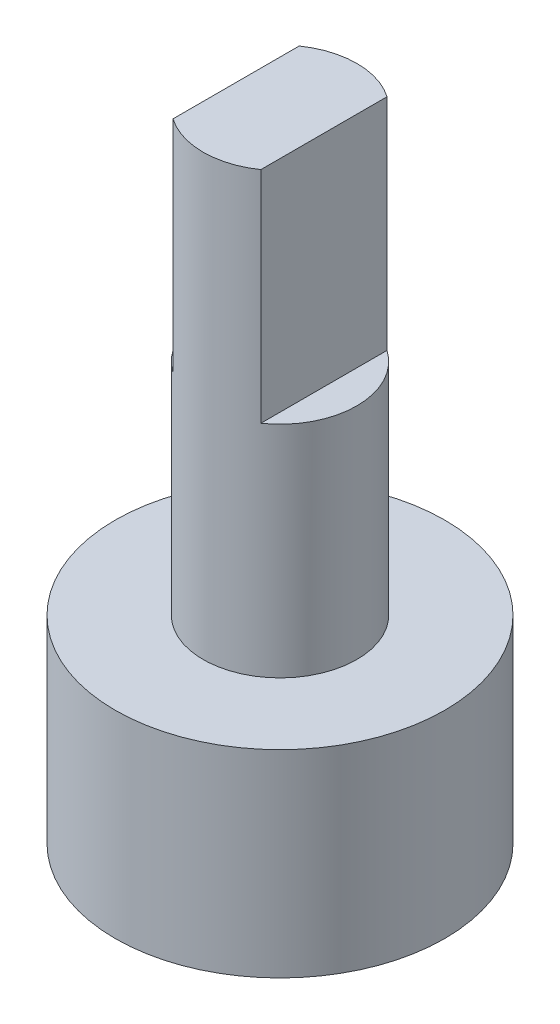
ISO-10303-21;
HEADER;
FILE_DESCRIPTION(('STEP AP214'),'2;1');
FILE_NAME('part.step','',(''),(''),'','','');
FILE_SCHEMA(('AUTOMOTIVE_DESIGN { 1 0 10303 214 1 1 1 1 }'));
ENDSEC;
DATA;
#1=APPLICATION_CONTEXT('core data for automotive mechanical design processes');
#2=APPLICATION_PROTOCOL_DEFINITION('international standard','automotive_design',2000,#1);
#3=PRODUCT_CONTEXT('',#1,'mechanical');
#4=PRODUCT('Part','Part','',(#3));
#5=PRODUCT_RELATED_PRODUCT_CATEGORY('part','',(#4));
#6=PRODUCT_DEFINITION_FORMATION('','',#4);
#7=PRODUCT_DEFINITION_CONTEXT('part definition',#1,'design');
#8=PRODUCT_DEFINITION('design','',#6,#7);
#9=PRODUCT_DEFINITION_SHAPE('','',#8);
#10=(LENGTH_UNIT() NAMED_UNIT(*) SI_UNIT(.MILLI.,.METRE.));
#11=(NAMED_UNIT(*) PLANE_ANGLE_UNIT() SI_UNIT($,.RADIAN.));
#12=(NAMED_UNIT(*) SI_UNIT($,.STERADIAN.) SOLID_ANGLE_UNIT());
#13=UNCERTAINTY_MEASURE_WITH_UNIT(LENGTH_MEASURE(1.E-05),#10,'distance_accuracy_value','');
#14=(GEOMETRIC_REPRESENTATION_CONTEXT(3) GLOBAL_UNCERTAINTY_ASSIGNED_CONTEXT((#13)) GLOBAL_UNIT_ASSIGNED_CONTEXT((#10,
#11,#12)) REPRESENTATION_CONTEXT('',''));
#15=CARTESIAN_POINT('',(0.,0.,0.));
#16=DIRECTION('',(0.,0.,1.));
#17=DIRECTION('',(1.,0.,0.));
#18=AXIS2_PLACEMENT_3D('',#15,#16,#17);
#19=CARTESIAN_POINT('',(0.,10.,0.));
#20=DIRECTION('',(0.,-1.,0.));
#21=DIRECTION('',(0.,0.,-1.));
#22=AXIS2_PLACEMENT_3D('',#19,#20,#21);
#23=CYLINDRICAL_SURFACE('',#22,1.75);
#24=CARTESIAN_POINT('',(0.,10.,0.));
#25=DIRECTION('',(0.,1.,0.));
#26=DIRECTION('',(0.,0.,1.));
#27=AXIS2_PLACEMENT_3D('',#24,#25,#26);
#28=CIRCLE('',#27,1.75);
#29=CARTESIAN_POINT('',(1.,10.,-1.43614066163451));
#30=VERTEX_POINT('',#29);
#31=CARTESIAN_POINT('',(-1.,10.,-1.43614066163451));
#32=VERTEX_POINT('',#31);
#33=EDGE_CURVE('E38',#30,#32,#28,.T.);
#34=ORIENTED_EDGE('',*,*,#33,.F.);
#35=DIRECTION('',(0.,1.,0.));
#36=VECTOR('',#35,1.);
#37=CARTESIAN_POINT('',(1.,5.,-1.43614066163451));
#38=LINE('',#37,#36);
#39=CARTESIAN_POINT('',(1.,5.,-1.43614066163451));
#40=VERTEX_POINT('',#39);
#41=EDGE_CURVE('E45',#40,#30,#38,.T.);
#42=ORIENTED_EDGE('',*,*,#41,.F.);
#43=CARTESIAN_POINT('',(0.,5.,0.));
#44=DIRECTION('',(0.,1.,0.));
#45=DIRECTION('',(0.,0.,1.));
#46=AXIS2_PLACEMENT_3D('',#43,#44,#45);
#47=CIRCLE('',#46,1.75);
#48=CARTESIAN_POINT('',(1.,5.,1.43614066163451));
#49=VERTEX_POINT('',#48);
#50=EDGE_CURVE('E74',#49,#40,#47,.T.);
#51=ORIENTED_EDGE('',*,*,#50,.F.);
#52=DIRECTION('',(0.,1.,0.));
#53=VECTOR('',#52,1.);
#54=CARTESIAN_POINT('',(1.,5.,1.43614066163451));
#55=LINE('',#54,#53);
#56=CARTESIAN_POINT('',(1.,10.,1.43614066163451));
#57=VERTEX_POINT('',#56);
#58=EDGE_CURVE('E82',#49,#57,#55,.T.);
#59=ORIENTED_EDGE('',*,*,#58,.T.);
#60=CARTESIAN_POINT('',(-1.,10.,1.43614066163451));
#61=VERTEX_POINT('',#60);
#62=EDGE_CURVE('E11',#61,#57,#28,.T.);
#63=ORIENTED_EDGE('',*,*,#62,.F.);
#64=DIRECTION('',(0.,1.,0.));
#65=VECTOR('',#64,1.);
#66=CARTESIAN_POINT('',(-1.,5.,1.43614066163451));
#67=LINE('',#66,#65);
#68=CARTESIAN_POINT('',(-1.,5.,1.43614066163451));
#69=VERTEX_POINT('',#68);
#70=EDGE_CURVE('E53',#69,#61,#67,.T.);
#71=ORIENTED_EDGE('',*,*,#70,.F.);
#72=CARTESIAN_POINT('',(0.,5.,0.));
#73=DIRECTION('',(0.,1.,0.));
#74=DIRECTION('',(0.,0.,1.));
#75=AXIS2_PLACEMENT_3D('',#72,#73,#74);
#76=CIRCLE('',#75,1.75);
#77=CARTESIAN_POINT('',(-1.,5.,-1.43614066163451));
#78=VERTEX_POINT('',#77);
#79=EDGE_CURVE('E92',#78,#69,#76,.T.);
#80=ORIENTED_EDGE('',*,*,#79,.F.);
#81=DIRECTION('',(0.,1.,0.));
#82=VECTOR('',#81,1.);
#83=CARTESIAN_POINT('',(-1.,5.,-1.43614066163451));
#84=LINE('',#83,#82);
#85=EDGE_CURVE('E98',#78,#32,#84,.T.);
#86=ORIENTED_EDGE('',*,*,#85,.T.);
#87=EDGE_LOOP('',(#34,#42,#51,#59,#63,#71,#80,#86));
#88=FACE_BOUND('',#87,.T.);
#89=CARTESIAN_POINT('',(0.,0.,0.));
#90=DIRECTION('',(0.,-1.,0.));
#91=DIRECTION('',(0.,0.,-1.));
#92=AXIS2_PLACEMENT_3D('',#89,#90,#91);
#93=CIRCLE('',#92,1.75);
#94=CARTESIAN_POINT('',(0.,0.,-1.75));
#95=VERTEX_POINT('',#94);
#96=EDGE_CURVE('E234',#95,#95,#93,.T.);
#97=ORIENTED_EDGE('',*,*,#96,.F.);
#98=EDGE_LOOP('',(#97));
#99=FACE_BOUND('',#98,.T.);
#100=ADVANCED_FACE('F31',(#88,#99),#23,.T.);
#101=CARTESIAN_POINT('',(0.,10.,0.));
#102=DIRECTION('',(0.,1.,0.));
#103=DIRECTION('',(0.,0.,1.));
#104=AXIS2_PLACEMENT_3D('',#101,#102,#103);
#105=PLANE('',#104);
#106=DIRECTION('',(0.,0.,1.));
#107=VECTOR('',#106,1.);
#108=CARTESIAN_POINT('',(1.,10.,-1.43614066163451));
#109=LINE('',#108,#107);
#110=EDGE_CURVE('E79',#30,#57,#109,.T.);
#111=ORIENTED_EDGE('',*,*,#110,.F.);
#112=ORIENTED_EDGE('',*,*,#33,.T.);
#113=DIRECTION('',(0.,0.,-1.));
#114=VECTOR('',#113,1.);
#115=CARTESIAN_POINT('',(-1.,10.,-1.43614066163451));
#116=LINE('',#115,#114);
#117=EDGE_CURVE('E88',#61,#32,#116,.T.);
#118=ORIENTED_EDGE('',*,*,#117,.F.);
#119=ORIENTED_EDGE('',*,*,#62,.T.);
#120=EDGE_LOOP('',(#111,#112,#118,#119));
#121=FACE_BOUND('',#120,.T.);
#122=ADVANCED_FACE('F101',(#121),#105,.T.);
#123=CARTESIAN_POINT('',(-1.,5.,-1.43614066163451));
#124=DIRECTION('',(1.,0.,0.));
#125=DIRECTION('',(0.,0.,-1.));
#126=AXIS2_PLACEMENT_3D('',#123,#124,#125);
#127=PLANE('',#126);
#128=ORIENTED_EDGE('',*,*,#117,.T.);
#129=ORIENTED_EDGE('',*,*,#85,.F.);
#130=DIRECTION('',(0.,0.,-1.));
#131=VECTOR('',#130,1.);
#132=CARTESIAN_POINT('',(-1.,5.,-1.43614066163451));
#133=LINE('',#132,#131);
#134=EDGE_CURVE('E94',#69,#78,#133,.T.);
#135=ORIENTED_EDGE('',*,*,#134,.F.);
#136=ORIENTED_EDGE('',*,*,#70,.T.);
#137=EDGE_LOOP('',(#128,#129,#135,#136));
#138=FACE_BOUND('',#137,.T.);
#139=ADVANCED_FACE('F103',(#138),#127,.F.);
#140=CARTESIAN_POINT('',(0.,5.,0.));
#141=DIRECTION('',(0.,1.,0.));
#142=DIRECTION('',(0.,0.,1.));
#143=AXIS2_PLACEMENT_3D('',#140,#141,#142);
#144=PLANE('',#143);
#145=ORIENTED_EDGE('',*,*,#79,.T.);
#146=ORIENTED_EDGE('',*,*,#134,.T.);
#147=EDGE_LOOP('',(#145,#146));
#148=FACE_BOUND('',#147,.T.);
#149=ADVANCED_FACE('F105',(#148),#144,.T.);
#150=CARTESIAN_POINT('',(1.,5.,-1.43614066163451));
#151=DIRECTION('',(-1.,0.,0.));
#152=DIRECTION('',(0.,0.,1.));
#153=AXIS2_PLACEMENT_3D('',#150,#151,#152);
#154=PLANE('',#153);
#155=ORIENTED_EDGE('',*,*,#110,.T.);
#156=ORIENTED_EDGE('',*,*,#58,.F.);
#157=DIRECTION('',(0.,0.,1.));
#158=VECTOR('',#157,1.);
#159=CARTESIAN_POINT('',(1.,5.,-1.43614066163451));
#160=LINE('',#159,#158);
#161=EDGE_CURVE('E76',#40,#49,#160,.T.);
#162=ORIENTED_EDGE('',*,*,#161,.F.);
#163=ORIENTED_EDGE('',*,*,#41,.T.);
#164=EDGE_LOOP('',(#155,#156,#162,#163));
#165=FACE_BOUND('',#164,.T.);
#166=ADVANCED_FACE('F81',(#165),#154,.F.);
#167=CARTESIAN_POINT('',(0.,5.,0.));
#168=DIRECTION('',(0.,1.,0.));
#169=DIRECTION('',(0.,0.,1.));
#170=AXIS2_PLACEMENT_3D('',#167,#168,#169);
#171=PLANE('',#170);
#172=ORIENTED_EDGE('',*,*,#50,.T.);
#173=ORIENTED_EDGE('',*,*,#161,.T.);
#174=EDGE_LOOP('',(#172,#173));
#175=FACE_BOUND('',#174,.T.);
#176=ADVANCED_FACE('F75',(#175),#171,.T.);
#177=CARTESIAN_POINT('',(0.,0.,0.));
#178=DIRECTION('',(0.,-1.,0.));
#179=DIRECTION('',(0.,0.,-1.));
#180=AXIS2_PLACEMENT_3D('',#177,#178,#179);
#181=PLANE('',#180);
#182=CARTESIAN_POINT('',(0.,0.,0.));
#183=DIRECTION('',(0.,-1.,0.));
#184=DIRECTION('',(0.,0.,-1.));
#185=AXIS2_PLACEMENT_3D('',#182,#183,#184);
#186=CIRCLE('',#185,3.75);
#187=CARTESIAN_POINT('',(0.,0.,-3.75));
#188=VERTEX_POINT('',#187);
#189=EDGE_CURVE('E229',#188,#188,#186,.T.);
#190=ORIENTED_EDGE('',*,*,#189,.F.);
#191=EDGE_LOOP('',(#190));
#192=FACE_BOUND('',#191,.T.);
#193=ORIENTED_EDGE('',*,*,#96,.T.);
#194=EDGE_LOOP('',(#193));
#195=FACE_BOUND('',#194,.T.);
#196=ADVANCED_FACE('F143',(#192,#195),#181,.F.);
#197=CARTESIAN_POINT('',(0.,-4.5,0.));
#198=DIRECTION('',(0.,1.,0.));
#199=DIRECTION('',(0.,0.,1.));
#200=AXIS2_PLACEMENT_3D('',#197,#198,#199);
#201=CYLINDRICAL_SURFACE('',#200,3.75);
#202=CARTESIAN_POINT('',(0.,-4.5,0.));
#203=DIRECTION('',(0.,-1.,0.));
#204=DIRECTION('',(0.,0.,-1.));
#205=AXIS2_PLACEMENT_3D('',#202,#203,#204);
#206=CIRCLE('',#205,3.75);
#207=CARTESIAN_POINT('',(0.,-4.5,-3.75));
#208=VERTEX_POINT('',#207);
#209=EDGE_CURVE('E231',#208,#208,#206,.T.);
#210=ORIENTED_EDGE('',*,*,#209,.F.);
#211=EDGE_LOOP('',(#210));
#212=FACE_BOUND('',#211,.T.);
#213=ORIENTED_EDGE('',*,*,#189,.T.);
#214=EDGE_LOOP('',(#213));
#215=FACE_BOUND('',#214,.T.);
#216=ADVANCED_FACE('F152',(#212,#215),#201,.T.);
#217=CARTESIAN_POINT('',(0.,-4.5,0.));
#218=DIRECTION('',(0.,-1.,0.));
#219=DIRECTION('',(0.,0.,-1.));
#220=AXIS2_PLACEMENT_3D('',#217,#218,#219);
#221=PLANE('',#220);
#222=CARTESIAN_POINT('',(0.,-4.5,0.));
#223=DIRECTION('',(0.,-1.,0.));
#224=DIRECTION('',(0.,0.,-1.));
#225=AXIS2_PLACEMENT_3D('',#222,#223,#224);
#226=CIRCLE('',#225,3.25);
#227=CARTESIAN_POINT('',(0.,-4.5,-3.25));
#228=VERTEX_POINT('',#227);
#229=EDGE_CURVE('E219',#228,#228,#226,.T.);
#230=ORIENTED_EDGE('',*,*,#229,.F.);
#231=EDGE_LOOP('',(#230));
#232=FACE_BOUND('',#231,.T.);
#233=ORIENTED_EDGE('',*,*,#209,.T.);
#234=EDGE_LOOP('',(#233));
#235=FACE_BOUND('',#234,.T.);
#236=ADVANCED_FACE('F162',(#232,#235),#221,.T.);
#237=CARTESIAN_POINT('',(0.,-2.,0.));
#238=DIRECTION('',(0.,-1.,0.));
#239=DIRECTION('',(0.,0.,-1.));
#240=AXIS2_PLACEMENT_3D('',#237,#238,#239);
#241=CYLINDRICAL_SURFACE('',#240,3.25);
#242=CARTESIAN_POINT('',(0.,-2.,0.));
#243=DIRECTION('',(0.,-1.,0.));
#244=DIRECTION('',(0.,0.,-1.));
#245=AXIS2_PLACEMENT_3D('',#242,#243,#244);
#246=CIRCLE('',#245,3.25);
#247=CARTESIAN_POINT('',(0.,-2.,-3.25));
#248=VERTEX_POINT('',#247);
#249=EDGE_CURVE('E223',#248,#248,#246,.T.);
#250=ORIENTED_EDGE('',*,*,#249,.F.);
#251=EDGE_LOOP('',(#250));
#252=FACE_BOUND('',#251,.T.);
#253=ORIENTED_EDGE('',*,*,#229,.T.);
#254=EDGE_LOOP('',(#253));
#255=FACE_BOUND('',#254,.T.);
#256=ADVANCED_FACE('F172',(#252,#255),#241,.F.);
#257=CARTESIAN_POINT('',(0.,-2.,0.));
#258=DIRECTION('',(0.,-1.,0.));
#259=DIRECTION('',(0.,0.,-1.));
#260=AXIS2_PLACEMENT_3D('',#257,#258,#259);
#261=PLANE('',#260);
#262=CARTESIAN_POINT('',(0.,-2.,0.));
#263=DIRECTION('',(0.,-1.,0.));
#264=DIRECTION('',(0.,0.,-1.));
#265=AXIS2_PLACEMENT_3D('',#262,#263,#264);
#266=CIRCLE('',#265,2.5);
#267=CARTESIAN_POINT('',(0.,-2.,-2.5));
#268=VERTEX_POINT('',#267);
#269=EDGE_CURVE('E220',#268,#268,#266,.T.);
#270=ORIENTED_EDGE('',*,*,#269,.F.);
#271=EDGE_LOOP('',(#270));
#272=FACE_BOUND('',#271,.T.);
#273=ORIENTED_EDGE('',*,*,#249,.T.);
#274=EDGE_LOOP('',(#273));
#275=FACE_BOUND('',#274,.T.);
#276=ADVANCED_FACE('F182',(#272,#275),#261,.T.);
#277=CARTESIAN_POINT('',(0.,-1.,0.));
#278=DIRECTION('',(0.,-1.,0.));
#279=DIRECTION('',(0.,0.,-1.));
#280=AXIS2_PLACEMENT_3D('',#277,#278,#279);
#281=CYLINDRICAL_SURFACE('',#280,2.5);
#282=CARTESIAN_POINT('',(0.,-1.,0.));
#283=DIRECTION('',(0.,-1.,0.));
#284=DIRECTION('',(0.,0.,-1.));
#285=AXIS2_PLACEMENT_3D('',#282,#283,#284);
#286=CIRCLE('',#285,2.5);
#287=CARTESIAN_POINT('',(0.,-1.,-2.5));
#288=VERTEX_POINT('',#287);
#289=EDGE_CURVE('E218',#288,#288,#286,.T.);
#290=ORIENTED_EDGE('',*,*,#289,.F.);
#291=EDGE_LOOP('',(#290));
#292=FACE_BOUND('',#291,.T.);
#293=ORIENTED_EDGE('',*,*,#269,.T.);
#294=EDGE_LOOP('',(#293));
#295=FACE_BOUND('',#294,.T.);
#296=ADVANCED_FACE('F192',(#292,#295),#281,.F.);
#297=CARTESIAN_POINT('',(0.,-1.,0.));
#298=DIRECTION('',(0.,-1.,0.));
#299=DIRECTION('',(0.,0.,-1.));
#300=AXIS2_PLACEMENT_3D('',#297,#298,#299);
#301=PLANE('',#300);
#302=ORIENTED_EDGE('',*,*,#289,.T.);
#303=EDGE_LOOP('',(#302));
#304=FACE_BOUND('',#303,.T.);
#305=ADVANCED_FACE('F202',(#304),#301,.T.);
#306=CLOSED_SHELL('',(#100,#122,#139,#149,#166,#176,#196,#216,#236,#256,#276,#296,#305));
#307=MANIFOLD_SOLID_BREP('B2',#306);
#308=ADVANCED_BREP_SHAPE_REPRESENTATION('',(#18,#307),#14);
#309=SHAPE_DEFINITION_REPRESENTATION(#9,#308);
ENDSEC;
END-ISO-10303-21;
